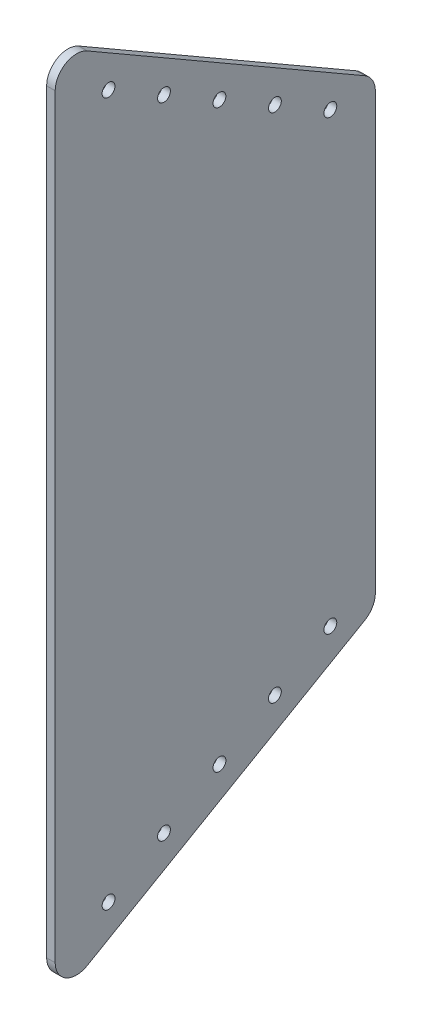
ISO-10303-21;
HEADER;
FILE_DESCRIPTION(('STEP AP214'),'2;1');
FILE_NAME('part.step','',(''),(''),'','','');
FILE_SCHEMA(('AUTOMOTIVE_DESIGN { 1 0 10303 214 1 1 1 1 }'));
ENDSEC;
DATA;
#1=APPLICATION_CONTEXT('core data for automotive mechanical design processes');
#2=APPLICATION_PROTOCOL_DEFINITION('international standard','automotive_design',2000,#1);
#3=PRODUCT_CONTEXT('',#1,'mechanical');
#4=PRODUCT('Part','Part','',(#3));
#5=PRODUCT_RELATED_PRODUCT_CATEGORY('part','',(#4));
#6=PRODUCT_DEFINITION_FORMATION('','',#4);
#7=PRODUCT_DEFINITION_CONTEXT('part definition',#1,'design');
#8=PRODUCT_DEFINITION('design','',#6,#7);
#9=PRODUCT_DEFINITION_SHAPE('','',#8);
#10=(LENGTH_UNIT() NAMED_UNIT(*) SI_UNIT(.MILLI.,.METRE.));
#11=(NAMED_UNIT(*) PLANE_ANGLE_UNIT() SI_UNIT($,.RADIAN.));
#12=(NAMED_UNIT(*) SI_UNIT($,.STERADIAN.) SOLID_ANGLE_UNIT());
#13=UNCERTAINTY_MEASURE_WITH_UNIT(LENGTH_MEASURE(1.E-05),#10,'distance_accuracy_value','');
#14=(GEOMETRIC_REPRESENTATION_CONTEXT(3) GLOBAL_UNCERTAINTY_ASSIGNED_CONTEXT((#13)) GLOBAL_UNIT_ASSIGNED_CONTEXT((#10,
#11,#12)) REPRESENTATION_CONTEXT('',''));
#15=CARTESIAN_POINT('',(0.,0.,0.));
#16=DIRECTION('',(0.,0.,1.));
#17=DIRECTION('',(1.,0.,0.));
#18=AXIS2_PLACEMENT_3D('',#15,#16,#17);
#19=CARTESIAN_POINT('',(-4.,-150.,75.0000000000001));
#20=DIRECTION('',(1.,0.,0.));
#21=DIRECTION('',(0.,0.,-1.));
#22=AXIS2_PLACEMENT_3D('',#19,#20,#21);
#23=PLANE('',#22);
#24=CARTESIAN_POINT('',(-3.99999999999999,-99.7816335794323,24.0192378864669));
#25=DIRECTION('',(1.,0.,0.));
#26=DIRECTION('',(0.,0.,-1.));
#27=AXIS2_PLACEMENT_3D('',#24,#25,#26);
#28=CIRCLE('',#27,3.);
#29=CARTESIAN_POINT('',(-3.99999999999999,-99.7816335794323,21.0192378864669));
#30=VERTEX_POINT('',#29);
#31=EDGE_CURVE('E246',#30,#30,#28,.F.);
#32=ORIENTED_EDGE('',*,*,#31,.F.);
#33=EDGE_LOOP('',(#32));
#34=FACE_BOUND('',#33,.T.);
#35=CARTESIAN_POINT('',(-3.99999999999999,-84.7816335794323,-1.96152422706628));
#36=DIRECTION('',(1.,0.,0.));
#37=DIRECTION('',(0.,0.,-1.));
#38=AXIS2_PLACEMENT_3D('',#35,#36,#37);
#39=CIRCLE('',#38,3.);
#40=CARTESIAN_POINT('',(-3.99999999999999,-84.7816335794323,-4.96152422706628));
#41=VERTEX_POINT('',#40);
#42=EDGE_CURVE('E251',#41,#41,#39,.F.);
#43=ORIENTED_EDGE('',*,*,#42,.F.);
#44=EDGE_LOOP('',(#43));
#45=FACE_BOUND('',#44,.T.);
#46=CARTESIAN_POINT('',(-3.99999999999999,-69.7816335794322,-27.9422863405994));
#47=DIRECTION('',(1.,0.,0.));
#48=DIRECTION('',(0.,0.,-1.));
#49=AXIS2_PLACEMENT_3D('',#46,#47,#48);
#50=CIRCLE('',#49,3.);
#51=CARTESIAN_POINT('',(-3.99999999999999,-69.7816335794322,-30.9422863405994));
#52=VERTEX_POINT('',#51);
#53=EDGE_CURVE('E257',#52,#52,#50,.F.);
#54=ORIENTED_EDGE('',*,*,#53,.F.);
#55=EDGE_LOOP('',(#54));
#56=FACE_BOUND('',#55,.T.);
#57=CARTESIAN_POINT('',(-3.99999999999999,-54.7816335794322,-53.9230484541326));
#58=DIRECTION('',(1.,0.,0.));
#59=DIRECTION('',(0.,0.,-1.));
#60=AXIS2_PLACEMENT_3D('',#57,#58,#59);
#61=CIRCLE('',#60,3.00000000000001);
#62=CARTESIAN_POINT('',(-3.99999999999999,-54.7816335794322,-56.9230484541326));
#63=VERTEX_POINT('',#62);
#64=EDGE_CURVE('E263',#63,#63,#61,.F.);
#65=ORIENTED_EDGE('',*,*,#64,.F.);
#66=EDGE_LOOP('',(#65));
#67=FACE_BOUND('',#66,.T.);
#68=CARTESIAN_POINT('',(-3.99999999999999,199.781633579431,24.0192378864669));
#69=DIRECTION('',(1.,0.,0.));
#70=DIRECTION('',(0.,0.,-1.));
#71=AXIS2_PLACEMENT_3D('',#68,#69,#70);
#72=CIRCLE('',#71,3.);
#73=CARTESIAN_POINT('',(-3.99999999999999,199.781633579431,21.0192378864669));
#74=VERTEX_POINT('',#73);
#75=EDGE_CURVE('E269',#74,#74,#72,.F.);
#76=ORIENTED_EDGE('',*,*,#75,.F.);
#77=EDGE_LOOP('',(#76));
#78=FACE_BOUND('',#77,.T.);
#79=CARTESIAN_POINT('',(-4.,214.781633579431,50.));
#80=DIRECTION('',(1.,0.,0.));
#81=DIRECTION('',(0.,0.,-1.));
#82=AXIS2_PLACEMENT_3D('',#79,#80,#81);
#83=CIRCLE('',#82,3.);
#84=CARTESIAN_POINT('',(-4.,214.781633579431,47.));
#85=VERTEX_POINT('',#84);
#86=EDGE_CURVE('E275',#85,#85,#83,.F.);
#87=ORIENTED_EDGE('',*,*,#86,.F.);
#88=EDGE_LOOP('',(#87));
#89=FACE_BOUND('',#88,.T.);
#90=CARTESIAN_POINT('',(-3.99999999999999,184.781633579431,-1.96152422706629));
#91=DIRECTION('',(1.,0.,0.));
#92=DIRECTION('',(0.,0.,-1.));
#93=AXIS2_PLACEMENT_3D('',#90,#91,#92);
#94=CIRCLE('',#93,3.);
#95=CARTESIAN_POINT('',(-3.99999999999999,184.781633579431,-4.96152422706629));
#96=VERTEX_POINT('',#95);
#97=EDGE_CURVE('E281',#96,#96,#94,.F.);
#98=ORIENTED_EDGE('',*,*,#97,.F.);
#99=EDGE_LOOP('',(#98));
#100=FACE_BOUND('',#99,.T.);
#101=CARTESIAN_POINT('',(-3.99999999999999,169.781633579431,-27.9422863405994));
#102=DIRECTION('',(1.,0.,0.));
#103=DIRECTION('',(0.,0.,-1.));
#104=AXIS2_PLACEMENT_3D('',#101,#102,#103);
#105=CIRCLE('',#104,3.);
#106=CARTESIAN_POINT('',(-3.99999999999999,169.781633579431,-30.9422863405994));
#107=VERTEX_POINT('',#106);
#108=EDGE_CURVE('E287',#107,#107,#105,.F.);
#109=ORIENTED_EDGE('',*,*,#108,.F.);
#110=EDGE_LOOP('',(#109));
#111=FACE_BOUND('',#110,.T.);
#112=CARTESIAN_POINT('',(-3.99999999999999,154.781633579431,-53.9230484541326));
#113=DIRECTION('',(1.,0.,0.));
#114=DIRECTION('',(0.,0.,-1.));
#115=AXIS2_PLACEMENT_3D('',#112,#113,#114);
#116=CIRCLE('',#115,3.00000000000001);
#117=CARTESIAN_POINT('',(-3.99999999999999,154.781633579431,-56.9230484541326));
#118=VERTEX_POINT('',#117);
#119=EDGE_CURVE('E293',#118,#118,#116,.F.);
#120=ORIENTED_EDGE('',*,*,#119,.F.);
#121=EDGE_LOOP('',(#120));
#122=FACE_BOUND('',#121,.T.);
#123=CARTESIAN_POINT('',(-4.,-114.781633579432,50.));
#124=DIRECTION('',(1.,0.,0.));
#125=DIRECTION('',(0.,0.,-1.));
#126=AXIS2_PLACEMENT_3D('',#123,#124,#125);
#127=CIRCLE('',#126,3.);
#128=CARTESIAN_POINT('',(-4.,-114.781633579432,47.));
#129=VERTEX_POINT('',#128);
#130=EDGE_CURVE('E118',#129,#129,#127,.F.);
#131=ORIENTED_EDGE('',*,*,#130,.F.);
#132=EDGE_LOOP('',(#131));
#133=FACE_BOUND('',#132,.T.);
#134=DIRECTION('',(0.,0.500000000000006,-0.866025403784436));
#135=VECTOR('',#134,1.);
#136=CARTESIAN_POINT('',(-4.,-150.,85.0000000000007));
#137=LINE('',#136,#135);
#138=CARTESIAN_POINT('',(-3.99999999999998,-60.5107082756063,-70.));
#139=VERTEX_POINT('',#138);
#140=CARTESIAN_POINT('',(-4.,-135.566243270259,60.));
#141=VERTEX_POINT('',#140);
#142=EDGE_CURVE('E101',#139,#141,#137,.F.);
#143=ORIENTED_EDGE('',*,*,#142,.T.);
#144=CARTESIAN_POINT('',(-4.,-126.905989232414,65.0000000000001));
#145=DIRECTION('',(1.,0.,0.));
#146=DIRECTION('',(0.,0.,-1.));
#147=AXIS2_PLACEMENT_3D('',#144,#145,#146);
#148=CIRCLE('',#147,10.);
#149=CARTESIAN_POINT('',(-4.,-126.905989232414,75.0000000000001));
#150=VERTEX_POINT('',#149);
#151=EDGE_CURVE('E97',#141,#150,#148,.F.);
#152=ORIENTED_EDGE('',*,*,#151,.T.);
#153=DIRECTION('',(0.,1.,0.));
#154=VECTOR('',#153,1.);
#155=CARTESIAN_POINT('',(-4.,-150.,75.0000000000001));
#156=LINE('',#155,#154);
#157=CARTESIAN_POINT('',(-4.,226.905989232414,75.));
#158=VERTEX_POINT('',#157);
#159=EDGE_CURVE('E99',#150,#158,#156,.T.);
#160=ORIENTED_EDGE('',*,*,#159,.T.);
#161=CARTESIAN_POINT('',(-4.,226.905989232414,65.));
#162=DIRECTION('',(1.,0.,0.));
#163=DIRECTION('',(0.,0.,-1.));
#164=AXIS2_PLACEMENT_3D('',#161,#162,#163);
#165=CIRCLE('',#164,10.);
#166=CARTESIAN_POINT('',(-4.,235.566243270259,60.));
#167=VERTEX_POINT('',#166);
#168=EDGE_CURVE('E55',#158,#167,#165,.F.);
#169=ORIENTED_EDGE('',*,*,#168,.T.);
#170=DIRECTION('',(0.,-0.500000000000006,-0.866025403784436));
#171=VECTOR('',#170,1.);
#172=CARTESIAN_POINT('',(-3.99999999999998,157.623956929658,-75.));
#173=LINE('',#172,#171);
#174=CARTESIAN_POINT('',(-3.99999999999998,160.510708275606,-70.));
#175=VERTEX_POINT('',#174);
#176=EDGE_CURVE('E161',#167,#175,#173,.T.);
#177=ORIENTED_EDGE('',*,*,#176,.T.);
#178=CARTESIAN_POINT('',(-3.99999999999998,151.850454237762,-65.));
#179=DIRECTION('',(1.,0.,0.));
#180=DIRECTION('',(0.,0.,-1.));
#181=AXIS2_PLACEMENT_3D('',#178,#179,#180);
#182=CIRCLE('',#181,10.);
#183=CARTESIAN_POINT('',(-3.99999999999998,151.850454237762,-75.));
#184=VERTEX_POINT('',#183);
#185=EDGE_CURVE('E137',#175,#184,#182,.F.);
#186=ORIENTED_EDGE('',*,*,#185,.T.);
#187=DIRECTION('',(0.,1.,0.));
#188=VECTOR('',#187,1.);
#189=CARTESIAN_POINT('',(-3.99999999999998,-150.,-74.9999999999999));
#190=LINE('',#189,#188);
#191=CARTESIAN_POINT('',(-3.99999999999998,-51.8504542377619,-75.));
#192=VERTEX_POINT('',#191);
#193=EDGE_CURVE('E151',#192,#184,#190,.T.);
#194=ORIENTED_EDGE('',*,*,#193,.F.);
#195=CARTESIAN_POINT('',(-3.99999999999998,-51.8504542377619,-65.));
#196=DIRECTION('',(1.,0.,0.));
#197=DIRECTION('',(0.,0.,-1.));
#198=AXIS2_PLACEMENT_3D('',#195,#196,#197);
#199=CIRCLE('',#198,10.);
#200=EDGE_CURVE('E106',#192,#139,#199,.F.);
#201=ORIENTED_EDGE('',*,*,#200,.T.);
#202=EDGE_LOOP('',(#143,#152,#160,#169,#177,#186,#194,#201));
#203=FACE_BOUND('',#202,.T.);
#204=ADVANCED_FACE('F34',(#34,#45,#56,#67,#78,#89,#100,#111,#122,#133,#203),#23,.F.);
#205=CARTESIAN_POINT('',(0.,-150.,-74.9999999999999));
#206=DIRECTION('',(0.,0.,1.));
#207=DIRECTION('',(0.,-1.,0.));
#208=AXIS2_PLACEMENT_3D('',#205,#206,#207);
#209=PLANE('',#208);
#210=DIRECTION('',(0.,1.,0.));
#211=VECTOR('',#210,1.);
#212=CARTESIAN_POINT('',(0.,-150.,-74.9999999999999));
#213=LINE('',#212,#211);
#214=CARTESIAN_POINT('',(0.,-51.8504542377619,-75.));
#215=VERTEX_POINT('',#214);
#216=CARTESIAN_POINT('',(0.,151.850454237762,-75.));
#217=VERTEX_POINT('',#216);
#218=EDGE_CURVE('E154',#215,#217,#213,.T.);
#219=ORIENTED_EDGE('',*,*,#218,.F.);
#220=DIRECTION('',(1.,0.,0.));
#221=VECTOR('',#220,1.);
#222=CARTESIAN_POINT('',(-3.99999999999998,-51.8504542377619,-75.));
#223=LINE('',#222,#221);
#224=EDGE_CURVE('E143',#215,#192,#223,.F.);
#225=ORIENTED_EDGE('',*,*,#224,.T.);
#226=ORIENTED_EDGE('',*,*,#193,.T.);
#227=DIRECTION('',(1.,0.,0.));
#228=VECTOR('',#227,1.);
#229=CARTESIAN_POINT('',(0.,151.850454237762,-75.));
#230=LINE('',#229,#228);
#231=EDGE_CURVE('E105',#184,#217,#230,.T.);
#232=ORIENTED_EDGE('',*,*,#231,.T.);
#233=EDGE_LOOP('',(#219,#225,#226,#232));
#234=FACE_BOUND('',#233,.T.);
#235=ADVANCED_FACE('F150',(#234),#209,.F.);
#236=CARTESIAN_POINT('',(0.,-150.,75.));
#237=DIRECTION('',(-1.,0.,0.));
#238=DIRECTION('',(0.,0.,1.));
#239=AXIS2_PLACEMENT_3D('',#236,#237,#238);
#240=PLANE('',#239);
#241=CARTESIAN_POINT('',(0.,-99.7816335794323,24.0192378864669));
#242=DIRECTION('',(1.,0.,0.));
#243=DIRECTION('',(0.,0.,-1.));
#244=AXIS2_PLACEMENT_3D('',#241,#242,#243);
#245=CIRCLE('',#244,3.);
#246=CARTESIAN_POINT('',(0.,-99.7816335794323,21.0192378864669));
#247=VERTEX_POINT('',#246);
#248=EDGE_CURVE('E244',#247,#247,#245,.T.);
#249=ORIENTED_EDGE('',*,*,#248,.F.);
#250=EDGE_LOOP('',(#249));
#251=FACE_BOUND('',#250,.T.);
#252=CARTESIAN_POINT('',(0.,-84.7816335794323,-1.96152422706627));
#253=DIRECTION('',(1.,0.,0.));
#254=DIRECTION('',(0.,0.,-1.));
#255=AXIS2_PLACEMENT_3D('',#252,#253,#254);
#256=CIRCLE('',#255,3.);
#257=CARTESIAN_POINT('',(0.,-84.7816335794323,-4.96152422706628));
#258=VERTEX_POINT('',#257);
#259=EDGE_CURVE('E254',#258,#258,#256,.T.);
#260=ORIENTED_EDGE('',*,*,#259,.F.);
#261=EDGE_LOOP('',(#260));
#262=FACE_BOUND('',#261,.T.);
#263=CARTESIAN_POINT('',(0.,-69.7816335794322,-27.9422863405994));
#264=DIRECTION('',(1.,0.,0.));
#265=DIRECTION('',(0.,0.,-1.));
#266=AXIS2_PLACEMENT_3D('',#263,#264,#265);
#267=CIRCLE('',#266,3.);
#268=CARTESIAN_POINT('',(0.,-69.7816335794322,-30.9422863405994));
#269=VERTEX_POINT('',#268);
#270=EDGE_CURVE('E260',#269,#269,#267,.T.);
#271=ORIENTED_EDGE('',*,*,#270,.F.);
#272=EDGE_LOOP('',(#271));
#273=FACE_BOUND('',#272,.T.);
#274=CARTESIAN_POINT('',(0.,-54.7816335794322,-53.9230484541326));
#275=DIRECTION('',(1.,0.,0.));
#276=DIRECTION('',(0.,0.,-1.));
#277=AXIS2_PLACEMENT_3D('',#274,#275,#276);
#278=CIRCLE('',#277,3.00000000000001);
#279=CARTESIAN_POINT('',(0.,-54.7816335794322,-56.9230484541326));
#280=VERTEX_POINT('',#279);
#281=EDGE_CURVE('E266',#280,#280,#278,.T.);
#282=ORIENTED_EDGE('',*,*,#281,.F.);
#283=EDGE_LOOP('',(#282));
#284=FACE_BOUND('',#283,.T.);
#285=CARTESIAN_POINT('',(0.,199.781633579431,24.0192378864669));
#286=DIRECTION('',(1.,0.,0.));
#287=DIRECTION('',(0.,0.,-1.));
#288=AXIS2_PLACEMENT_3D('',#285,#286,#287);
#289=CIRCLE('',#288,3.);
#290=CARTESIAN_POINT('',(0.,199.781633579431,21.0192378864669));
#291=VERTEX_POINT('',#290);
#292=EDGE_CURVE('E272',#291,#291,#289,.T.);
#293=ORIENTED_EDGE('',*,*,#292,.F.);
#294=EDGE_LOOP('',(#293));
#295=FACE_BOUND('',#294,.T.);
#296=CARTESIAN_POINT('',(0.,214.781633579431,50.));
#297=DIRECTION('',(1.,0.,0.));
#298=DIRECTION('',(0.,0.,-1.));
#299=AXIS2_PLACEMENT_3D('',#296,#297,#298);
#300=CIRCLE('',#299,3.);
#301=CARTESIAN_POINT('',(0.,214.781633579431,47.));
#302=VERTEX_POINT('',#301);
#303=EDGE_CURVE('E278',#302,#302,#300,.T.);
#304=ORIENTED_EDGE('',*,*,#303,.F.);
#305=EDGE_LOOP('',(#304));
#306=FACE_BOUND('',#305,.T.);
#307=CARTESIAN_POINT('',(0.,184.781633579431,-1.96152422706629));
#308=DIRECTION('',(1.,0.,0.));
#309=DIRECTION('',(0.,0.,-1.));
#310=AXIS2_PLACEMENT_3D('',#307,#308,#309);
#311=CIRCLE('',#310,3.);
#312=CARTESIAN_POINT('',(0.,184.781633579431,-4.96152422706629));
#313=VERTEX_POINT('',#312);
#314=EDGE_CURVE('E284',#313,#313,#311,.T.);
#315=ORIENTED_EDGE('',*,*,#314,.F.);
#316=EDGE_LOOP('',(#315));
#317=FACE_BOUND('',#316,.T.);
#318=CARTESIAN_POINT('',(0.,169.781633579431,-27.9422863405994));
#319=DIRECTION('',(1.,0.,0.));
#320=DIRECTION('',(0.,0.,-1.));
#321=AXIS2_PLACEMENT_3D('',#318,#319,#320);
#322=CIRCLE('',#321,3.);
#323=CARTESIAN_POINT('',(0.,169.781633579431,-30.9422863405994));
#324=VERTEX_POINT('',#323);
#325=EDGE_CURVE('E290',#324,#324,#322,.T.);
#326=ORIENTED_EDGE('',*,*,#325,.F.);
#327=EDGE_LOOP('',(#326));
#328=FACE_BOUND('',#327,.T.);
#329=CARTESIAN_POINT('',(0.,154.781633579431,-53.9230484541326));
#330=DIRECTION('',(1.,0.,0.));
#331=DIRECTION('',(0.,0.,-1.));
#332=AXIS2_PLACEMENT_3D('',#329,#330,#331);
#333=CIRCLE('',#332,3.00000000000001);
#334=CARTESIAN_POINT('',(0.,154.781633579431,-56.9230484541326));
#335=VERTEX_POINT('',#334);
#336=EDGE_CURVE('E296',#335,#335,#333,.T.);
#337=ORIENTED_EDGE('',*,*,#336,.F.);
#338=EDGE_LOOP('',(#337));
#339=FACE_BOUND('',#338,.T.);
#340=CARTESIAN_POINT('',(0.,-114.781633579432,50.));
#341=DIRECTION('',(1.,0.,0.));
#342=DIRECTION('',(0.,0.,-1.));
#343=AXIS2_PLACEMENT_3D('',#340,#341,#342);
#344=CIRCLE('',#343,3.);
#345=CARTESIAN_POINT('',(0.,-114.781633579432,47.));
#346=VERTEX_POINT('',#345);
#347=EDGE_CURVE('E247',#346,#346,#344,.T.);
#348=ORIENTED_EDGE('',*,*,#347,.F.);
#349=EDGE_LOOP('',(#348));
#350=FACE_BOUND('',#349,.T.);
#351=DIRECTION('',(0.,1.,0.));
#352=VECTOR('',#351,1.);
#353=CARTESIAN_POINT('',(0.,-150.,75.));
#354=LINE('',#353,#352);
#355=CARTESIAN_POINT('',(0.,-126.905989232414,75.));
#356=VERTEX_POINT('',#355);
#357=CARTESIAN_POINT('',(0.,226.905989232414,75.));
#358=VERTEX_POINT('',#357);
#359=EDGE_CURVE('E117',#356,#358,#354,.T.);
#360=ORIENTED_EDGE('',*,*,#359,.F.);
#361=CARTESIAN_POINT('',(0.,-126.905989232414,65.));
#362=DIRECTION('',(-1.,0.,0.));
#363=DIRECTION('',(0.,0.,1.));
#364=AXIS2_PLACEMENT_3D('',#361,#362,#363);
#365=CIRCLE('',#364,10.);
#366=CARTESIAN_POINT('',(0.,-135.566243270259,60.));
#367=VERTEX_POINT('',#366);
#368=EDGE_CURVE('E121',#356,#367,#365,.F.);
#369=ORIENTED_EDGE('',*,*,#368,.T.);
#370=DIRECTION('',(0.,-0.500000000000006,0.866025403784436));
#371=VECTOR('',#370,1.);
#372=CARTESIAN_POINT('',(0.,-150.,85.0000000000007));
#373=LINE('',#372,#371);
#374=CARTESIAN_POINT('',(0.,-60.5107082756063,-70.));
#375=VERTEX_POINT('',#374);
#376=EDGE_CURVE('E167',#367,#375,#373,.F.);
#377=ORIENTED_EDGE('',*,*,#376,.T.);
#378=CARTESIAN_POINT('',(0.,-51.8504542377619,-65.));
#379=DIRECTION('',(-1.,0.,0.));
#380=DIRECTION('',(0.,0.,1.));
#381=AXIS2_PLACEMENT_3D('',#378,#379,#380);
#382=CIRCLE('',#381,10.);
#383=EDGE_CURVE('E130',#375,#215,#382,.F.);
#384=ORIENTED_EDGE('',*,*,#383,.T.);
#385=ORIENTED_EDGE('',*,*,#218,.T.);
#386=CARTESIAN_POINT('',(0.,151.850454237762,-65.));
#387=DIRECTION('',(-1.,0.,0.));
#388=DIRECTION('',(0.,0.,1.));
#389=AXIS2_PLACEMENT_3D('',#386,#387,#388);
#390=CIRCLE('',#389,10.);
#391=CARTESIAN_POINT('',(0.,160.510708275606,-70.));
#392=VERTEX_POINT('',#391);
#393=EDGE_CURVE('E122',#217,#392,#390,.F.);
#394=ORIENTED_EDGE('',*,*,#393,.T.);
#395=DIRECTION('',(0.,0.500000000000006,0.866025403784436));
#396=VECTOR('',#395,1.);
#397=CARTESIAN_POINT('',(0.,157.623956929658,-75.));
#398=LINE('',#397,#396);
#399=CARTESIAN_POINT('',(0.,235.566243270259,60.));
#400=VERTEX_POINT('',#399);
#401=EDGE_CURVE('E158',#392,#400,#398,.T.);
#402=ORIENTED_EDGE('',*,*,#401,.T.);
#403=CARTESIAN_POINT('',(0.,226.905989232414,65.));
#404=DIRECTION('',(-1.,0.,0.));
#405=DIRECTION('',(0.,0.,1.));
#406=AXIS2_PLACEMENT_3D('',#403,#404,#405);
#407=CIRCLE('',#406,10.);
#408=EDGE_CURVE('E124',#400,#358,#407,.F.);
#409=ORIENTED_EDGE('',*,*,#408,.T.);
#410=EDGE_LOOP('',(#360,#369,#377,#384,#385,#394,#402,#409));
#411=FACE_BOUND('',#410,.T.);
#412=ADVANCED_FACE('F171',(#251,#262,#273,#284,#295,#306,#317,#328,#339,#350,#411),#240,.F.);
#413=CARTESIAN_POINT('',(0.,-150.,75.));
#414=DIRECTION('',(0.,0.,-1.));
#415=DIRECTION('',(-1.,0.,0.));
#416=AXIS2_PLACEMENT_3D('',#413,#414,#415);
#417=PLANE('',#416);
#418=ORIENTED_EDGE('',*,*,#159,.F.);
#419=DIRECTION('',(-1.,0.,0.));
#420=VECTOR('',#419,1.);
#421=CARTESIAN_POINT('',(0.,-126.905989232414,75.));
#422=LINE('',#421,#420);
#423=EDGE_CURVE('E113',#150,#356,#422,.F.);
#424=ORIENTED_EDGE('',*,*,#423,.T.);
#425=ORIENTED_EDGE('',*,*,#359,.T.);
#426=DIRECTION('',(-1.,0.,0.));
#427=VECTOR('',#426,1.);
#428=CARTESIAN_POINT('',(-4.00000000000004,226.905989232414,75.));
#429=LINE('',#428,#427);
#430=EDGE_CURVE('E116',#358,#158,#429,.T.);
#431=ORIENTED_EDGE('',*,*,#430,.T.);
#432=EDGE_LOOP('',(#418,#424,#425,#431));
#433=FACE_BOUND('',#432,.T.);
#434=ADVANCED_FACE('F111',(#433),#417,.F.);
#435=CARTESIAN_POINT('',(0.,157.623956929658,-75.));
#436=DIRECTION('',(0.,0.866025403784435,-0.500000000000006));
#437=DIRECTION('',(-1.,0.,0.));
#438=AXIS2_PLACEMENT_3D('',#435,#436,#437);
#439=PLANE('',#438);
#440=ORIENTED_EDGE('',*,*,#176,.F.);
#441=DIRECTION('',(-1.,0.,0.));
#442=VECTOR('',#441,1.);
#443=CARTESIAN_POINT('',(0.,235.566243270259,59.9999999999999));
#444=LINE('',#443,#442);
#445=EDGE_CURVE('E11',#167,#400,#444,.F.);
#446=ORIENTED_EDGE('',*,*,#445,.T.);
#447=ORIENTED_EDGE('',*,*,#401,.F.);
#448=DIRECTION('',(1.,0.,0.));
#449=VECTOR('',#448,1.);
#450=CARTESIAN_POINT('',(-3.99999999999998,160.510708275606,-70.));
#451=LINE('',#450,#449);
#452=EDGE_CURVE('E42',#392,#175,#451,.F.);
#453=ORIENTED_EDGE('',*,*,#452,.T.);
#454=EDGE_LOOP('',(#440,#446,#447,#453));
#455=FACE_BOUND('',#454,.T.);
#456=ADVANCED_FACE('F177',(#455),#439,.T.);
#457=CARTESIAN_POINT('',(0.,-150.,85.0000000000007));
#458=DIRECTION('',(0.,0.866025403784435,0.500000000000005));
#459=DIRECTION('',(1.,0.,0.));
#460=AXIS2_PLACEMENT_3D('',#457,#458,#459);
#461=PLANE('',#460);
#462=ORIENTED_EDGE('',*,*,#376,.F.);
#463=DIRECTION('',(1.,0.,0.));
#464=VECTOR('',#463,1.);
#465=CARTESIAN_POINT('',(-4.00000000000007,-135.566243270259,60.));
#466=LINE('',#465,#464);
#467=EDGE_CURVE('E135',#367,#141,#466,.F.);
#468=ORIENTED_EDGE('',*,*,#467,.T.);
#469=ORIENTED_EDGE('',*,*,#142,.F.);
#470=DIRECTION('',(-1.,0.,0.));
#471=VECTOR('',#470,1.);
#472=CARTESIAN_POINT('',(0.,-60.5107082756063,-70.));
#473=LINE('',#472,#471);
#474=EDGE_CURVE('E133',#139,#375,#473,.F.);
#475=ORIENTED_EDGE('',*,*,#474,.T.);
#476=EDGE_LOOP('',(#462,#468,#469,#475));
#477=FACE_BOUND('',#476,.T.);
#478=ADVANCED_FACE('F175',(#477),#461,.F.);
#479=CARTESIAN_POINT('',(0.,-126.905989232414,65.));
#480=DIRECTION('',(1.,0.,0.));
#481=DIRECTION('',(0.,0.,-1.));
#482=AXIS2_PLACEMENT_3D('',#479,#480,#481);
#483=CYLINDRICAL_SURFACE('',#482,10.);
#484=ORIENTED_EDGE('',*,*,#151,.F.);
#485=ORIENTED_EDGE('',*,*,#467,.F.);
#486=ORIENTED_EDGE('',*,*,#368,.F.);
#487=ORIENTED_EDGE('',*,*,#423,.F.);
#488=EDGE_LOOP('',(#484,#485,#486,#487));
#489=FACE_BOUND('',#488,.T.);
#490=ADVANCED_FACE('F120',(#489),#483,.T.);
#491=CARTESIAN_POINT('',(0.,-51.8504542377619,-65.));
#492=DIRECTION('',(-1.,0.,0.));
#493=DIRECTION('',(0.,0.,1.));
#494=AXIS2_PLACEMENT_3D('',#491,#492,#493);
#495=CYLINDRICAL_SURFACE('',#494,10.);
#496=ORIENTED_EDGE('',*,*,#383,.F.);
#497=ORIENTED_EDGE('',*,*,#474,.F.);
#498=ORIENTED_EDGE('',*,*,#200,.F.);
#499=ORIENTED_EDGE('',*,*,#224,.F.);
#500=EDGE_LOOP('',(#496,#497,#498,#499));
#501=FACE_BOUND('',#500,.T.);
#502=ADVANCED_FACE('F174',(#501),#495,.T.);
#503=CARTESIAN_POINT('',(7.19042880792387E-13,226.905989232414,65.));
#504=DIRECTION('',(1.,0.,0.));
#505=DIRECTION('',(0.,0.,-1.));
#506=AXIS2_PLACEMENT_3D('',#503,#504,#505);
#507=CYLINDRICAL_SURFACE('',#506,10.);
#508=ORIENTED_EDGE('',*,*,#408,.F.);
#509=ORIENTED_EDGE('',*,*,#445,.F.);
#510=ORIENTED_EDGE('',*,*,#168,.F.);
#511=ORIENTED_EDGE('',*,*,#430,.F.);
#512=EDGE_LOOP('',(#508,#509,#510,#511));
#513=FACE_BOUND('',#512,.T.);
#514=ADVANCED_FACE('F304',(#513),#507,.T.);
#515=CARTESIAN_POINT('',(0.,151.850454237762,-65.));
#516=DIRECTION('',(-1.,0.,0.));
#517=DIRECTION('',(0.,0.,1.));
#518=AXIS2_PLACEMENT_3D('',#515,#516,#517);
#519=CYLINDRICAL_SURFACE('',#518,10.);
#520=ORIENTED_EDGE('',*,*,#185,.F.);
#521=ORIENTED_EDGE('',*,*,#452,.F.);
#522=ORIENTED_EDGE('',*,*,#393,.F.);
#523=ORIENTED_EDGE('',*,*,#231,.F.);
#524=EDGE_LOOP('',(#520,#521,#522,#523));
#525=FACE_BOUND('',#524,.T.);
#526=ADVANCED_FACE('F36',(#525),#519,.T.);
#527=CARTESIAN_POINT('',(-4.00100000000002,-114.781633579432,50.));
#528=DIRECTION('',(1.,0.,0.));
#529=DIRECTION('',(0.,0.,-1.));
#530=AXIS2_PLACEMENT_3D('',#527,#528,#529);
#531=CYLINDRICAL_SURFACE('',#530,3.);
#532=ORIENTED_EDGE('',*,*,#347,.T.);
#533=EDGE_LOOP('',(#532));
#534=FACE_BOUND('',#533,.T.);
#535=ORIENTED_EDGE('',*,*,#130,.T.);
#536=EDGE_LOOP('',(#535));
#537=FACE_BOUND('',#536,.T.);
#538=ADVANCED_FACE('F200',(#534,#537),#531,.F.);
#539=CARTESIAN_POINT('',(-4.001,154.781633579431,-53.9230484541326));
#540=DIRECTION('',(1.,0.,0.));
#541=DIRECTION('',(0.,0.,-1.));
#542=AXIS2_PLACEMENT_3D('',#539,#540,#541);
#543=CYLINDRICAL_SURFACE('',#542,3.00000000000001);
#544=ORIENTED_EDGE('',*,*,#336,.T.);
#545=EDGE_LOOP('',(#544));
#546=FACE_BOUND('',#545,.T.);
#547=ORIENTED_EDGE('',*,*,#119,.T.);
#548=EDGE_LOOP('',(#547));
#549=FACE_BOUND('',#548,.T.);
#550=ADVANCED_FACE('F203',(#546,#549),#543,.F.);
#551=CARTESIAN_POINT('',(-4.00100000000001,169.781633579431,-27.9422863405994));
#552=DIRECTION('',(1.,0.,0.));
#553=DIRECTION('',(0.,0.,-1.));
#554=AXIS2_PLACEMENT_3D('',#551,#552,#553);
#555=CYLINDRICAL_SURFACE('',#554,3.);
#556=ORIENTED_EDGE('',*,*,#325,.T.);
#557=EDGE_LOOP('',(#556));
#558=FACE_BOUND('',#557,.T.);
#559=ORIENTED_EDGE('',*,*,#108,.T.);
#560=EDGE_LOOP('',(#559));
#561=FACE_BOUND('',#560,.T.);
#562=ADVANCED_FACE('F207',(#558,#561),#555,.F.);
#563=CARTESIAN_POINT('',(-4.00100000000001,184.781633579431,-1.96152422706629));
#564=DIRECTION('',(1.,0.,0.));
#565=DIRECTION('',(0.,0.,-1.));
#566=AXIS2_PLACEMENT_3D('',#563,#564,#565);
#567=CYLINDRICAL_SURFACE('',#566,3.);
#568=ORIENTED_EDGE('',*,*,#314,.T.);
#569=EDGE_LOOP('',(#568));
#570=FACE_BOUND('',#569,.T.);
#571=ORIENTED_EDGE('',*,*,#97,.T.);
#572=EDGE_LOOP('',(#571));
#573=FACE_BOUND('',#572,.T.);
#574=ADVANCED_FACE('F211',(#570,#573),#567,.F.);
#575=CARTESIAN_POINT('',(-4.00100000000002,214.781633579431,50.));
#576=DIRECTION('',(1.,0.,0.));
#577=DIRECTION('',(0.,0.,-1.));
#578=AXIS2_PLACEMENT_3D('',#575,#576,#577);
#579=CYLINDRICAL_SURFACE('',#578,3.);
#580=ORIENTED_EDGE('',*,*,#303,.T.);
#581=EDGE_LOOP('',(#580));
#582=FACE_BOUND('',#581,.T.);
#583=ORIENTED_EDGE('',*,*,#86,.T.);
#584=EDGE_LOOP('',(#583));
#585=FACE_BOUND('',#584,.T.);
#586=ADVANCED_FACE('F215',(#582,#585),#579,.F.);
#587=CARTESIAN_POINT('',(-4.00100000000001,199.781633579431,24.0192378864669));
#588=DIRECTION('',(1.,0.,0.));
#589=DIRECTION('',(0.,0.,-1.));
#590=AXIS2_PLACEMENT_3D('',#587,#588,#589);
#591=CYLINDRICAL_SURFACE('',#590,3.);
#592=ORIENTED_EDGE('',*,*,#292,.T.);
#593=EDGE_LOOP('',(#592));
#594=FACE_BOUND('',#593,.T.);
#595=ORIENTED_EDGE('',*,*,#75,.T.);
#596=EDGE_LOOP('',(#595));
#597=FACE_BOUND('',#596,.T.);
#598=ADVANCED_FACE('F219',(#594,#597),#591,.F.);
#599=CARTESIAN_POINT('',(-4.001,-54.7816335794322,-53.9230484541326));
#600=DIRECTION('',(1.,0.,0.));
#601=DIRECTION('',(0.,0.,-1.));
#602=AXIS2_PLACEMENT_3D('',#599,#600,#601);
#603=CYLINDRICAL_SURFACE('',#602,3.00000000000001);
#604=ORIENTED_EDGE('',*,*,#281,.T.);
#605=EDGE_LOOP('',(#604));
#606=FACE_BOUND('',#605,.T.);
#607=ORIENTED_EDGE('',*,*,#64,.T.);
#608=EDGE_LOOP('',(#607));
#609=FACE_BOUND('',#608,.T.);
#610=ADVANCED_FACE('F223',(#606,#609),#603,.F.);
#611=CARTESIAN_POINT('',(-4.00100000000001,-69.7816335794322,-27.9422863405994));
#612=DIRECTION('',(1.,0.,0.));
#613=DIRECTION('',(0.,0.,-1.));
#614=AXIS2_PLACEMENT_3D('',#611,#612,#613);
#615=CYLINDRICAL_SURFACE('',#614,3.);
#616=ORIENTED_EDGE('',*,*,#270,.T.);
#617=EDGE_LOOP('',(#616));
#618=FACE_BOUND('',#617,.T.);
#619=ORIENTED_EDGE('',*,*,#53,.T.);
#620=EDGE_LOOP('',(#619));
#621=FACE_BOUND('',#620,.T.);
#622=ADVANCED_FACE('F227',(#618,#621),#615,.F.);
#623=CARTESIAN_POINT('',(-4.00100000000001,-84.7816335794323,-1.96152422706628));
#624=DIRECTION('',(1.,0.,0.));
#625=DIRECTION('',(0.,0.,-1.));
#626=AXIS2_PLACEMENT_3D('',#623,#624,#625);
#627=CYLINDRICAL_SURFACE('',#626,3.);
#628=ORIENTED_EDGE('',*,*,#259,.T.);
#629=EDGE_LOOP('',(#628));
#630=FACE_BOUND('',#629,.T.);
#631=ORIENTED_EDGE('',*,*,#42,.T.);
#632=EDGE_LOOP('',(#631));
#633=FACE_BOUND('',#632,.T.);
#634=ADVANCED_FACE('F231',(#630,#633),#627,.F.);
#635=CARTESIAN_POINT('',(-4.00100000000001,-99.7816335794323,24.0192378864669));
#636=DIRECTION('',(1.,0.,0.));
#637=DIRECTION('',(0.,0.,-1.));
#638=AXIS2_PLACEMENT_3D('',#635,#636,#637);
#639=CYLINDRICAL_SURFACE('',#638,3.);
#640=ORIENTED_EDGE('',*,*,#248,.T.);
#641=EDGE_LOOP('',(#640));
#642=FACE_BOUND('',#641,.T.);
#643=ORIENTED_EDGE('',*,*,#31,.T.);
#644=EDGE_LOOP('',(#643));
#645=FACE_BOUND('',#644,.T.);
#646=ADVANCED_FACE('F235',(#642,#645),#639,.F.);
#647=CLOSED_SHELL('',(#204,#235,#412,#434,#456,#478,#490,#502,#514,#526,#538,#550,#562,#574,
#586,#598,#610,#622,#634,#646));
#648=MANIFOLD_SOLID_BREP('B2',#647);
#649=ADVANCED_BREP_SHAPE_REPRESENTATION('',(#18,#648),#14);
#650=SHAPE_DEFINITION_REPRESENTATION(#9,#649);
ENDSEC;
END-ISO-10303-21;
